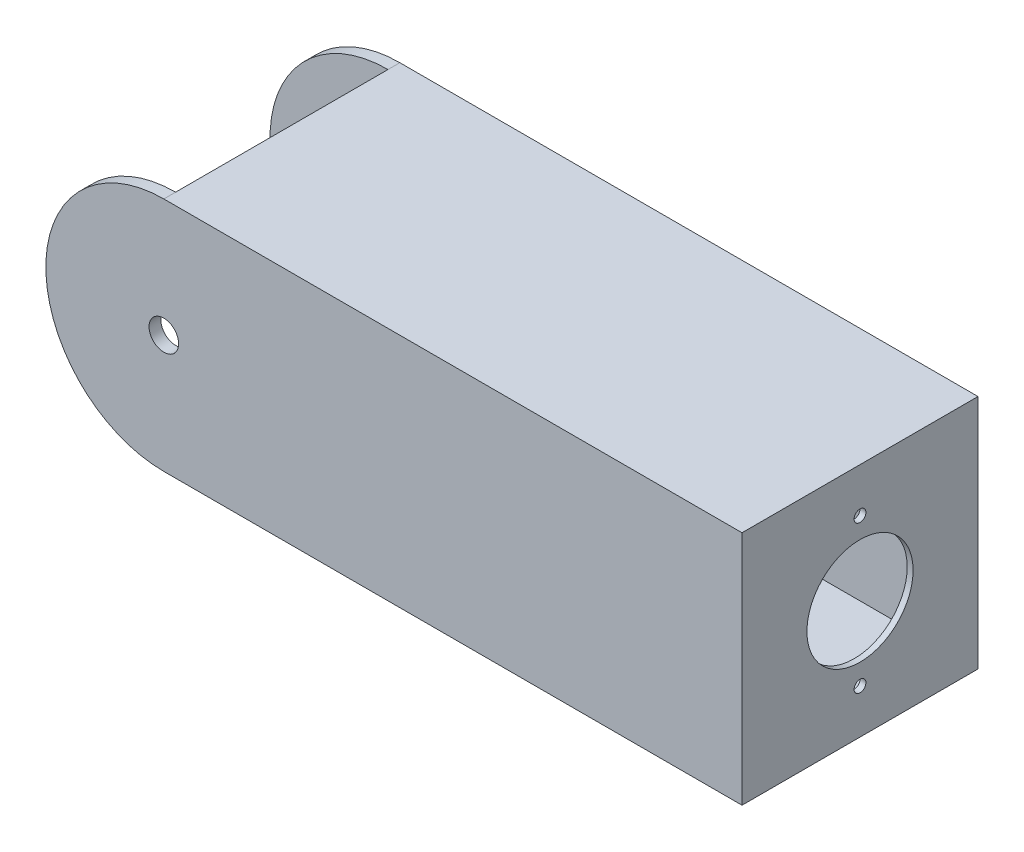
ISO-10303-21;
HEADER;
FILE_DESCRIPTION(('STEP AP214'),'2;1');
FILE_NAME('part.step','',(''),(''),'','','');
FILE_SCHEMA(('AUTOMOTIVE_DESIGN { 1 0 10303 214 1 1 1 1 }'));
ENDSEC;
DATA;
#1=APPLICATION_CONTEXT('core data for automotive mechanical design processes');
#2=APPLICATION_PROTOCOL_DEFINITION('international standard','automotive_design',2000,#1);
#3=PRODUCT_CONTEXT('',#1,'mechanical');
#4=PRODUCT('Part','Part','',(#3));
#5=PRODUCT_RELATED_PRODUCT_CATEGORY('part','',(#4));
#6=PRODUCT_DEFINITION_FORMATION('','',#4);
#7=PRODUCT_DEFINITION_CONTEXT('part definition',#1,'design');
#8=PRODUCT_DEFINITION('design','',#6,#7);
#9=PRODUCT_DEFINITION_SHAPE('','',#8);
#10=(LENGTH_UNIT() NAMED_UNIT(*) SI_UNIT(.MILLI.,.METRE.));
#11=(NAMED_UNIT(*) PLANE_ANGLE_UNIT() SI_UNIT($,.RADIAN.));
#12=(NAMED_UNIT(*) SI_UNIT($,.STERADIAN.) SOLID_ANGLE_UNIT());
#13=UNCERTAINTY_MEASURE_WITH_UNIT(LENGTH_MEASURE(1.E-05),#10,'distance_accuracy_value','');
#14=(GEOMETRIC_REPRESENTATION_CONTEXT(3) GLOBAL_UNCERTAINTY_ASSIGNED_CONTEXT((#13)) GLOBAL_UNIT_ASSIGNED_CONTEXT((#10,
#11,#12)) REPRESENTATION_CONTEXT('',''));
#15=CARTESIAN_POINT('',(0.,0.,0.));
#16=DIRECTION('',(0.,0.,1.));
#17=DIRECTION('',(1.,0.,0.));
#18=AXIS2_PLACEMENT_3D('',#15,#16,#17);
#19=CARTESIAN_POINT('',(72.39,0.,0.));
#20=DIRECTION('',(-1.,0.,0.));
#21=DIRECTION('',(0.,0.,1.));
#22=AXIS2_PLACEMENT_3D('',#19,#20,#21);
#23=PLANE('',#22);
#24=DIRECTION('',(0.,1.,0.));
#25=VECTOR('',#24,1.);
#26=CARTESIAN_POINT('',(72.39,-22.86,-22.86));
#27=LINE('',#26,#25);
#28=CARTESIAN_POINT('',(72.39,-22.86,-22.86));
#29=VERTEX_POINT('',#28);
#30=CARTESIAN_POINT('',(72.39,22.86,-22.86));
#31=VERTEX_POINT('',#30);
#32=EDGE_CURVE('E152',#29,#31,#27,.T.);
#33=ORIENTED_EDGE('',*,*,#32,.F.);
#34=DIRECTION('',(0.,0.,-1.));
#35=VECTOR('',#34,1.);
#36=CARTESIAN_POINT('',(72.39,-22.86,22.86));
#37=LINE('',#36,#35);
#38=CARTESIAN_POINT('',(72.39,-22.86,22.86));
#39=VERTEX_POINT('',#38);
#40=EDGE_CURVE('E225',#39,#29,#37,.T.);
#41=ORIENTED_EDGE('',*,*,#40,.F.);
#42=DIRECTION('',(0.,-1.,0.));
#43=VECTOR('',#42,1.);
#44=CARTESIAN_POINT('',(72.39,-22.86,22.86));
#45=LINE('',#44,#43);
#46=CARTESIAN_POINT('',(72.39,22.86,22.86));
#47=VERTEX_POINT('',#46);
#48=EDGE_CURVE('E222',#47,#39,#45,.T.);
#49=ORIENTED_EDGE('',*,*,#48,.F.);
#50=DIRECTION('',(0.,0.,1.));
#51=VECTOR('',#50,1.);
#52=CARTESIAN_POINT('',(72.39,22.86,22.86));
#53=LINE('',#52,#51);
#54=EDGE_CURVE('E219',#31,#47,#53,.T.);
#55=ORIENTED_EDGE('',*,*,#54,.F.);
#56=EDGE_LOOP('',(#33,#41,#49,#55));
#57=FACE_BOUND('',#56,.T.);
#58=CARTESIAN_POINT('',(72.39,15.875,0.));
#59=DIRECTION('',(-1.,0.,0.));
#60=DIRECTION('',(0.,0.,1.));
#61=AXIS2_PLACEMENT_3D('',#58,#59,#60);
#62=CIRCLE('',#61,1.27);
#63=CARTESIAN_POINT('',(72.39,15.875,1.27));
#64=VERTEX_POINT('',#63);
#65=EDGE_CURVE('E285',#64,#64,#62,.F.);
#66=ORIENTED_EDGE('',*,*,#65,.T.);
#67=EDGE_LOOP('',(#66));
#68=FACE_BOUND('',#67,.T.);
#69=CARTESIAN_POINT('',(72.39,-15.875,0.));
#70=DIRECTION('',(-1.,0.,0.));
#71=DIRECTION('',(0.,0.,1.));
#72=AXIS2_PLACEMENT_3D('',#69,#70,#71);
#73=CIRCLE('',#72,1.27);
#74=CARTESIAN_POINT('',(72.39,-15.875,1.27));
#75=VERTEX_POINT('',#74);
#76=EDGE_CURVE('E290',#75,#75,#73,.F.);
#77=ORIENTED_EDGE('',*,*,#76,.T.);
#78=EDGE_LOOP('',(#77));
#79=FACE_BOUND('',#78,.T.);
#80=CARTESIAN_POINT('',(72.39,0.,0.));
#81=DIRECTION('',(-1.,0.,0.));
#82=DIRECTION('',(0.,0.,1.));
#83=AXIS2_PLACEMENT_3D('',#80,#81,#82);
#84=CIRCLE('',#83,11.43);
#85=CARTESIAN_POINT('',(72.39,0.,11.43));
#86=VERTEX_POINT('',#85);
#87=EDGE_CURVE('E292',#86,#86,#84,.F.);
#88=ORIENTED_EDGE('',*,*,#87,.T.);
#89=EDGE_LOOP('',(#88));
#90=FACE_BOUND('',#89,.T.);
#91=ADVANCED_FACE('F42',(#57,#68,#79,#90),#23,.T.);
#92=CARTESIAN_POINT('',(-50.8,0.,-25.4));
#93=DIRECTION('',(0.,0.,1.));
#94=DIRECTION('',(1.,0.,0.));
#95=AXIS2_PLACEMENT_3D('',#92,#93,#94);
#96=CYLINDRICAL_SURFACE('',#95,25.4);
#97=CARTESIAN_POINT('',(-50.8,0.,22.86));
#98=DIRECTION('',(0.,0.,1.));
#99=DIRECTION('',(1.,0.,0.));
#100=AXIS2_PLACEMENT_3D('',#97,#98,#99);
#101=CIRCLE('',#100,25.4);
#102=CARTESIAN_POINT('',(-50.8,-25.4,22.86));
#103=VERTEX_POINT('',#102);
#104=CARTESIAN_POINT('',(-50.8,25.4,22.86));
#105=VERTEX_POINT('',#104);
#106=EDGE_CURVE('E170',#103,#105,#101,.F.);
#107=ORIENTED_EDGE('',*,*,#106,.F.);
#108=DIRECTION('',(0.,0.,1.));
#109=VECTOR('',#108,1.);
#110=CARTESIAN_POINT('',(-50.8,-25.4,-25.4));
#111=LINE('',#110,#109);
#112=CARTESIAN_POINT('',(-50.8,-25.4,25.4));
#113=VERTEX_POINT('',#112);
#114=EDGE_CURVE('E151',#103,#113,#111,.T.);
#115=ORIENTED_EDGE('',*,*,#114,.T.);
#116=CARTESIAN_POINT('',(-50.8,0.,25.4));
#117=DIRECTION('',(0.,0.,1.));
#118=DIRECTION('',(1.,0.,0.));
#119=AXIS2_PLACEMENT_3D('',#116,#117,#118);
#120=CIRCLE('',#119,25.4);
#121=CARTESIAN_POINT('',(-50.8,25.4,25.4));
#122=VERTEX_POINT('',#121);
#123=EDGE_CURVE('E201',#122,#113,#120,.T.);
#124=ORIENTED_EDGE('',*,*,#123,.F.);
#125=DIRECTION('',(0.,0.,1.));
#126=VECTOR('',#125,1.);
#127=CARTESIAN_POINT('',(-50.8,25.4,-25.4));
#128=LINE('',#127,#126);
#129=EDGE_CURVE('E165',#105,#122,#128,.T.);
#130=ORIENTED_EDGE('',*,*,#129,.F.);
#131=EDGE_LOOP('',(#107,#115,#124,#130));
#132=FACE_BOUND('',#131,.T.);
#133=ADVANCED_FACE('F209',(#132),#96,.T.);
#134=CARTESIAN_POINT('',(-50.8,0.,-25.4));
#135=DIRECTION('',(0.,0.,1.));
#136=DIRECTION('',(1.,0.,0.));
#137=AXIS2_PLACEMENT_3D('',#134,#135,#136);
#138=CYLINDRICAL_SURFACE('',#137,3.18135);
#139=CARTESIAN_POINT('',(-50.8,0.,-22.86));
#140=DIRECTION('',(0.,0.,-1.));
#141=DIRECTION('',(-1.,0.,0.));
#142=AXIS2_PLACEMENT_3D('',#139,#140,#141);
#143=CIRCLE('',#142,3.18135);
#144=CARTESIAN_POINT('',(-53.98135,0.,-22.86));
#145=VERTEX_POINT('',#144);
#146=EDGE_CURVE('E134',#145,#145,#143,.F.);
#147=ORIENTED_EDGE('',*,*,#146,.T.);
#148=EDGE_LOOP('',(#147));
#149=FACE_BOUND('',#148,.T.);
#150=CARTESIAN_POINT('',(-50.8,0.,-25.4));
#151=DIRECTION('',(0.,0.,1.));
#152=DIRECTION('',(1.,0.,0.));
#153=AXIS2_PLACEMENT_3D('',#150,#151,#152);
#154=CIRCLE('',#153,3.18135);
#155=CARTESIAN_POINT('',(-47.61865,0.,-25.4));
#156=VERTEX_POINT('',#155);
#157=EDGE_CURVE('E183',#156,#156,#154,.T.);
#158=ORIENTED_EDGE('',*,*,#157,.F.);
#159=EDGE_LOOP('',(#158));
#160=FACE_BOUND('',#159,.T.);
#161=ADVANCED_FACE('F264',(#149,#160),#138,.F.);
#162=CARTESIAN_POINT('',(73.66,25.4,-25.4));
#163=DIRECTION('',(1.,0.,0.));
#164=DIRECTION('',(0.,0.,-1.));
#165=AXIS2_PLACEMENT_3D('',#162,#163,#164);
#166=PLANE('',#165);
#167=CARTESIAN_POINT('',(73.66,-15.875,0.));
#168=DIRECTION('',(1.,0.,0.));
#169=DIRECTION('',(0.,0.,-1.));
#170=AXIS2_PLACEMENT_3D('',#167,#168,#169);
#171=CIRCLE('',#170,1.27);
#172=CARTESIAN_POINT('',(73.66,-15.875,-1.27));
#173=VERTEX_POINT('',#172);
#174=EDGE_CURVE('E295',#173,#173,#171,.T.);
#175=ORIENTED_EDGE('',*,*,#174,.F.);
#176=EDGE_LOOP('',(#175));
#177=FACE_BOUND('',#176,.T.);
#178=CARTESIAN_POINT('',(73.66,15.875,0.));
#179=DIRECTION('',(1.,0.,0.));
#180=DIRECTION('',(0.,0.,-1.));
#181=AXIS2_PLACEMENT_3D('',#178,#179,#180);
#182=CIRCLE('',#181,1.27);
#183=CARTESIAN_POINT('',(73.66,15.875,-1.27));
#184=VERTEX_POINT('',#183);
#185=EDGE_CURVE('E288',#184,#184,#182,.T.);
#186=ORIENTED_EDGE('',*,*,#185,.F.);
#187=EDGE_LOOP('',(#186));
#188=FACE_BOUND('',#187,.T.);
#189=CARTESIAN_POINT('',(73.66,0.,0.));
#190=DIRECTION('',(1.,0.,0.));
#191=DIRECTION('',(0.,0.,-1.));
#192=AXIS2_PLACEMENT_3D('',#189,#190,#191);
#193=CIRCLE('',#192,11.43);
#194=CARTESIAN_POINT('',(73.66,0.,-11.43));
#195=VERTEX_POINT('',#194);
#196=EDGE_CURVE('E300',#195,#195,#193,.T.);
#197=ORIENTED_EDGE('',*,*,#196,.F.);
#198=EDGE_LOOP('',(#197));
#199=FACE_BOUND('',#198,.T.);
#200=DIRECTION('',(0.,1.,0.));
#201=VECTOR('',#200,1.);
#202=CARTESIAN_POINT('',(73.66,25.4,25.4));
#203=LINE('',#202,#201);
#204=CARTESIAN_POINT('',(73.66,-25.4,25.4));
#205=VERTEX_POINT('',#204);
#206=CARTESIAN_POINT('',(73.66,25.4,25.4));
#207=VERTEX_POINT('',#206);
#208=EDGE_CURVE('E186',#205,#207,#203,.T.);
#209=ORIENTED_EDGE('',*,*,#208,.F.);
#210=DIRECTION('',(0.,0.,1.));
#211=VECTOR('',#210,1.);
#212=CARTESIAN_POINT('',(73.66,-25.4,-25.4));
#213=LINE('',#212,#211);
#214=CARTESIAN_POINT('',(73.66,-25.4,-25.4));
#215=VERTEX_POINT('',#214);
#216=EDGE_CURVE('E50',#215,#205,#213,.T.);
#217=ORIENTED_EDGE('',*,*,#216,.F.);
#218=DIRECTION('',(0.,1.,0.));
#219=VECTOR('',#218,1.);
#220=CARTESIAN_POINT('',(73.66,25.4,-25.4));
#221=LINE('',#220,#219);
#222=CARTESIAN_POINT('',(73.66,25.4,-25.4));
#223=VERTEX_POINT('',#222);
#224=EDGE_CURVE('E189',#215,#223,#221,.T.);
#225=ORIENTED_EDGE('',*,*,#224,.T.);
#226=DIRECTION('',(0.,0.,1.));
#227=VECTOR('',#226,1.);
#228=CARTESIAN_POINT('',(73.66,25.4,-25.4));
#229=LINE('',#228,#227);
#230=EDGE_CURVE('E91',#223,#207,#229,.T.);
#231=ORIENTED_EDGE('',*,*,#230,.T.);
#232=EDGE_LOOP('',(#209,#217,#225,#231));
#233=FACE_BOUND('',#232,.T.);
#234=ADVANCED_FACE('F44',(#177,#188,#199,#233),#166,.T.);
#235=CARTESIAN_POINT('',(-50.8,-25.4,-25.4));
#236=DIRECTION('',(0.,-1.,0.));
#237=DIRECTION('',(1.,0.,0.));
#238=AXIS2_PLACEMENT_3D('',#235,#236,#237);
#239=PLANE('',#238);
#240=DIRECTION('',(1.,0.,0.));
#241=VECTOR('',#240,1.);
#242=CARTESIAN_POINT('',(-50.8,-25.4,25.4));
#243=LINE('',#242,#241);
#244=EDGE_CURVE('E192',#113,#205,#243,.T.);
#245=ORIENTED_EDGE('',*,*,#244,.F.);
#246=ORIENTED_EDGE('',*,*,#114,.F.);
#247=DIRECTION('',(0.,0.,1.));
#248=VECTOR('',#247,1.);
#249=CARTESIAN_POINT('',(-50.8,-25.4,-25.4));
#250=LINE('',#249,#248);
#251=CARTESIAN_POINT('',(-50.8,-25.4,-22.86));
#252=VERTEX_POINT('',#251);
#253=EDGE_CURVE('E140',#252,#103,#250,.T.);
#254=ORIENTED_EDGE('',*,*,#253,.F.);
#255=CARTESIAN_POINT('',(-50.8,-25.4,-25.4));
#256=VERTEX_POINT('',#255);
#257=EDGE_CURVE('E149',#256,#252,#111,.T.);
#258=ORIENTED_EDGE('',*,*,#257,.F.);
#259=DIRECTION('',(1.,0.,0.));
#260=VECTOR('',#259,1.);
#261=CARTESIAN_POINT('',(-50.8,-25.4,-25.4));
#262=LINE('',#261,#260);
#263=EDGE_CURVE('E167',#256,#215,#262,.T.);
#264=ORIENTED_EDGE('',*,*,#263,.T.);
#265=ORIENTED_EDGE('',*,*,#216,.T.);
#266=EDGE_LOOP('',(#245,#246,#254,#258,#264,#265));
#267=FACE_BOUND('',#266,.T.);
#268=ADVANCED_FACE('F148',(#267),#239,.T.);
#269=ORIENTED_EDGE('',*,*,#257,.T.);
#270=CARTESIAN_POINT('',(-50.8,0.,-22.86));
#271=DIRECTION('',(0.,0.,-1.));
#272=DIRECTION('',(-1.,0.,0.));
#273=AXIS2_PLACEMENT_3D('',#270,#271,#272);
#274=CIRCLE('',#273,25.4);
#275=CARTESIAN_POINT('',(-50.8,25.4,-22.86));
#276=VERTEX_POINT('',#275);
#277=EDGE_CURVE('E125',#276,#252,#274,.F.);
#278=ORIENTED_EDGE('',*,*,#277,.F.);
#279=CARTESIAN_POINT('',(-50.8,25.4,-25.4));
#280=VERTEX_POINT('',#279);
#281=EDGE_CURVE('E161',#280,#276,#128,.T.);
#282=ORIENTED_EDGE('',*,*,#281,.F.);
#283=CARTESIAN_POINT('',(-50.8,0.,-25.4));
#284=DIRECTION('',(0.,0.,1.));
#285=DIRECTION('',(1.,0.,0.));
#286=AXIS2_PLACEMENT_3D('',#283,#284,#285);
#287=CIRCLE('',#286,25.4);
#288=EDGE_CURVE('E157',#280,#256,#287,.T.);
#289=ORIENTED_EDGE('',*,*,#288,.T.);
#290=EDGE_LOOP('',(#269,#278,#282,#289));
#291=FACE_BOUND('',#290,.T.);
#292=ADVANCED_FACE('F155',(#291),#96,.T.);
#293=CARTESIAN_POINT('',(-50.8,25.4,-25.4));
#294=DIRECTION('',(0.,1.,0.));
#295=DIRECTION('',(0.,0.,1.));
#296=AXIS2_PLACEMENT_3D('',#293,#294,#295);
#297=PLANE('',#296);
#298=DIRECTION('',(-1.,0.,0.));
#299=VECTOR('',#298,1.);
#300=CARTESIAN_POINT('',(-50.8,25.4,25.4));
#301=LINE('',#300,#299);
#302=EDGE_CURVE('E198',#207,#122,#301,.T.);
#303=ORIENTED_EDGE('',*,*,#302,.F.);
#304=ORIENTED_EDGE('',*,*,#230,.F.);
#305=DIRECTION('',(-1.,0.,0.));
#306=VECTOR('',#305,1.);
#307=CARTESIAN_POINT('',(-50.8,25.4,-25.4));
#308=LINE('',#307,#306);
#309=EDGE_CURVE('E191',#223,#280,#308,.T.);
#310=ORIENTED_EDGE('',*,*,#309,.T.);
#311=ORIENTED_EDGE('',*,*,#281,.T.);
#312=DIRECTION('',(0.,0.,-1.));
#313=VECTOR('',#312,1.);
#314=CARTESIAN_POINT('',(-50.8,25.4,-25.4));
#315=LINE('',#314,#313);
#316=EDGE_CURVE('E153',#105,#276,#315,.T.);
#317=ORIENTED_EDGE('',*,*,#316,.F.);
#318=ORIENTED_EDGE('',*,*,#129,.T.);
#319=EDGE_LOOP('',(#303,#304,#310,#311,#317,#318));
#320=FACE_BOUND('',#319,.T.);
#321=ADVANCED_FACE('F211',(#320),#297,.T.);
#322=CARTESIAN_POINT('',(-50.8,0.,-25.4));
#323=DIRECTION('',(0.,0.,1.));
#324=DIRECTION('',(1.,0.,0.));
#325=AXIS2_PLACEMENT_3D('',#322,#323,#324);
#326=PLANE('',#325);
#327=ORIENTED_EDGE('',*,*,#157,.T.);
#328=EDGE_LOOP('',(#327));
#329=FACE_BOUND('',#328,.T.);
#330=ORIENTED_EDGE('',*,*,#224,.F.);
#331=ORIENTED_EDGE('',*,*,#263,.F.);
#332=ORIENTED_EDGE('',*,*,#288,.F.);
#333=ORIENTED_EDGE('',*,*,#309,.F.);
#334=EDGE_LOOP('',(#330,#331,#332,#333));
#335=FACE_BOUND('',#334,.T.);
#336=ADVANCED_FACE('F315',(#329,#335),#326,.F.);
#337=CARTESIAN_POINT('',(-50.8,0.,25.4));
#338=DIRECTION('',(0.,0.,1.));
#339=DIRECTION('',(1.,0.,0.));
#340=AXIS2_PLACEMENT_3D('',#337,#338,#339);
#341=PLANE('',#340);
#342=CARTESIAN_POINT('',(-50.8,0.,25.4));
#343=DIRECTION('',(0.,0.,1.));
#344=DIRECTION('',(1.,0.,0.));
#345=AXIS2_PLACEMENT_3D('',#342,#343,#344);
#346=CIRCLE('',#345,3.18135);
#347=CARTESIAN_POINT('',(-47.61865,0.,25.4));
#348=VERTEX_POINT('',#347);
#349=EDGE_CURVE('E133',#348,#348,#346,.T.);
#350=ORIENTED_EDGE('',*,*,#349,.F.);
#351=EDGE_LOOP('',(#350));
#352=FACE_BOUND('',#351,.T.);
#353=ORIENTED_EDGE('',*,*,#208,.T.);
#354=ORIENTED_EDGE('',*,*,#302,.T.);
#355=ORIENTED_EDGE('',*,*,#123,.T.);
#356=ORIENTED_EDGE('',*,*,#244,.T.);
#357=EDGE_LOOP('',(#353,#354,#355,#356));
#358=FACE_BOUND('',#357,.T.);
#359=ADVANCED_FACE('F205',(#352,#358),#341,.T.);
#360=CARTESIAN_POINT('',(-50.8,0.,22.86));
#361=DIRECTION('',(0.,0.,1.));
#362=DIRECTION('',(1.,0.,0.));
#363=AXIS2_PLACEMENT_3D('',#360,#361,#362);
#364=CIRCLE('',#363,3.18135);
#365=CARTESIAN_POINT('',(-47.61865,0.,22.86));
#366=VERTEX_POINT('',#365);
#367=EDGE_CURVE('E168',#366,#366,#364,.F.);
#368=ORIENTED_EDGE('',*,*,#367,.T.);
#369=EDGE_LOOP('',(#368));
#370=FACE_BOUND('',#369,.T.);
#371=ORIENTED_EDGE('',*,*,#349,.T.);
#372=EDGE_LOOP('',(#371));
#373=FACE_BOUND('',#372,.T.);
#374=ADVANCED_FACE('F252',(#370,#373),#138,.F.);
#375=CARTESIAN_POINT('',(-72.39,-22.86,-22.86));
#376=DIRECTION('',(0.,0.,-1.));
#377=DIRECTION('',(-1.,0.,0.));
#378=AXIS2_PLACEMENT_3D('',#375,#376,#377);
#379=PLANE('',#378);
#380=ORIENTED_EDGE('',*,*,#146,.F.);
#381=EDGE_LOOP('',(#380));
#382=FACE_BOUND('',#381,.T.);
#383=DIRECTION('',(1.,0.,0.));
#384=VECTOR('',#383,1.);
#385=CARTESIAN_POINT('',(-72.39,22.86,-22.86));
#386=LINE('',#385,#384);
#387=CARTESIAN_POINT('',(-50.8,22.86,-22.86));
#388=VERTEX_POINT('',#387);
#389=EDGE_CURVE('E180',#388,#31,#386,.T.);
#390=ORIENTED_EDGE('',*,*,#389,.F.);
#391=DIRECTION('',(0.,1.,0.));
#392=VECTOR('',#391,1.);
#393=CARTESIAN_POINT('',(-50.8,-83.82,-22.86));
#394=LINE('',#393,#392);
#395=EDGE_CURVE('E128',#388,#276,#394,.T.);
#396=ORIENTED_EDGE('',*,*,#395,.T.);
#397=ORIENTED_EDGE('',*,*,#277,.T.);
#398=CARTESIAN_POINT('',(-50.8,-22.86,-22.86));
#399=VERTEX_POINT('',#398);
#400=EDGE_CURVE('E57',#252,#399,#394,.T.);
#401=ORIENTED_EDGE('',*,*,#400,.T.);
#402=DIRECTION('',(1.,0.,0.));
#403=VECTOR('',#402,1.);
#404=CARTESIAN_POINT('',(-72.39,-22.86,-22.86));
#405=LINE('',#404,#403);
#406=EDGE_CURVE('E171',#399,#29,#405,.T.);
#407=ORIENTED_EDGE('',*,*,#406,.T.);
#408=ORIENTED_EDGE('',*,*,#32,.T.);
#409=EDGE_LOOP('',(#390,#396,#397,#401,#407,#408));
#410=FACE_BOUND('',#409,.T.);
#411=ADVANCED_FACE('F127',(#382,#410),#379,.F.);
#412=CARTESIAN_POINT('',(-72.39,-22.86,22.86));
#413=DIRECTION('',(0.,0.,1.));
#414=DIRECTION('',(1.,0.,0.));
#415=AXIS2_PLACEMENT_3D('',#412,#413,#414);
#416=PLANE('',#415);
#417=ORIENTED_EDGE('',*,*,#367,.F.);
#418=EDGE_LOOP('',(#417));
#419=FACE_BOUND('',#418,.T.);
#420=DIRECTION('',(1.,0.,0.));
#421=VECTOR('',#420,1.);
#422=CARTESIAN_POINT('',(-72.39,-22.86,22.86));
#423=LINE('',#422,#421);
#424=CARTESIAN_POINT('',(-50.8,-22.86,22.86));
#425=VERTEX_POINT('',#424);
#426=EDGE_CURVE('E229',#425,#39,#423,.T.);
#427=ORIENTED_EDGE('',*,*,#426,.F.);
#428=DIRECTION('',(0.,1.,0.));
#429=VECTOR('',#428,1.);
#430=CARTESIAN_POINT('',(-50.8,-83.82,22.86));
#431=LINE('',#430,#429);
#432=EDGE_CURVE('E214',#103,#425,#431,.T.);
#433=ORIENTED_EDGE('',*,*,#432,.F.);
#434=ORIENTED_EDGE('',*,*,#106,.T.);
#435=CARTESIAN_POINT('',(-50.8,22.86,22.86));
#436=VERTEX_POINT('',#435);
#437=EDGE_CURVE('E145',#436,#105,#431,.T.);
#438=ORIENTED_EDGE('',*,*,#437,.F.);
#439=DIRECTION('',(1.,0.,0.));
#440=VECTOR('',#439,1.);
#441=CARTESIAN_POINT('',(-72.39,22.86,22.86));
#442=LINE('',#441,#440);
#443=EDGE_CURVE('E230',#436,#47,#442,.T.);
#444=ORIENTED_EDGE('',*,*,#443,.T.);
#445=ORIENTED_EDGE('',*,*,#48,.T.);
#446=EDGE_LOOP('',(#427,#433,#434,#438,#444,#445));
#447=FACE_BOUND('',#446,.T.);
#448=ADVANCED_FACE('F243',(#419,#447),#416,.F.);
#449=CARTESIAN_POINT('',(-72.39,-22.86,22.86));
#450=DIRECTION('',(0.,-1.,0.));
#451=DIRECTION('',(0.,0.,-1.));
#452=AXIS2_PLACEMENT_3D('',#449,#450,#451);
#453=PLANE('',#452);
#454=ORIENTED_EDGE('',*,*,#406,.F.);
#455=DIRECTION('',(0.,0.,1.));
#456=VECTOR('',#455,1.);
#457=CARTESIAN_POINT('',(-50.8,-22.86,22.86));
#458=LINE('',#457,#456);
#459=EDGE_CURVE('E143',#399,#425,#458,.T.);
#460=ORIENTED_EDGE('',*,*,#459,.T.);
#461=ORIENTED_EDGE('',*,*,#426,.T.);
#462=ORIENTED_EDGE('',*,*,#40,.T.);
#463=EDGE_LOOP('',(#454,#460,#461,#462));
#464=FACE_BOUND('',#463,.T.);
#465=ADVANCED_FACE('F241',(#464),#453,.F.);
#466=CARTESIAN_POINT('',(-72.39,22.86,22.86));
#467=DIRECTION('',(0.,1.,0.));
#468=DIRECTION('',(0.,0.,1.));
#469=AXIS2_PLACEMENT_3D('',#466,#467,#468);
#470=PLANE('',#469);
#471=ORIENTED_EDGE('',*,*,#443,.F.);
#472=DIRECTION('',(0.,0.,-1.));
#473=VECTOR('',#472,1.);
#474=CARTESIAN_POINT('',(-50.8,22.86,22.86));
#475=LINE('',#474,#473);
#476=EDGE_CURVE('E11',#436,#388,#475,.T.);
#477=ORIENTED_EDGE('',*,*,#476,.T.);
#478=ORIENTED_EDGE('',*,*,#389,.T.);
#479=ORIENTED_EDGE('',*,*,#54,.T.);
#480=EDGE_LOOP('',(#471,#477,#478,#479));
#481=FACE_BOUND('',#480,.T.);
#482=ADVANCED_FACE('F235',(#481),#470,.F.);
#483=CARTESIAN_POINT('',(-50.8,-83.82,22.86));
#484=DIRECTION('',(1.,0.,0.));
#485=DIRECTION('',(0.,0.,-1.));
#486=AXIS2_PLACEMENT_3D('',#483,#484,#485);
#487=PLANE('',#486);
#488=ORIENTED_EDGE('',*,*,#316,.T.);
#489=ORIENTED_EDGE('',*,*,#395,.F.);
#490=ORIENTED_EDGE('',*,*,#476,.F.);
#491=ORIENTED_EDGE('',*,*,#437,.T.);
#492=EDGE_LOOP('',(#488,#489,#490,#491));
#493=FACE_BOUND('',#492,.T.);
#494=ADVANCED_FACE('F269',(#493),#487,.F.);
#495=ORIENTED_EDGE('',*,*,#253,.T.);
#496=ORIENTED_EDGE('',*,*,#432,.T.);
#497=ORIENTED_EDGE('',*,*,#459,.F.);
#498=ORIENTED_EDGE('',*,*,#400,.F.);
#499=EDGE_LOOP('',(#495,#496,#497,#498));
#500=FACE_BOUND('',#499,.T.);
#501=ADVANCED_FACE('F139',(#500),#487,.F.);
#502=CARTESIAN_POINT('',(-76.201,15.875,0.));
#503=DIRECTION('',(1.,0.,0.));
#504=DIRECTION('',(0.,0.,-1.));
#505=AXIS2_PLACEMENT_3D('',#502,#503,#504);
#506=CYLINDRICAL_SURFACE('',#505,1.27);
#507=ORIENTED_EDGE('',*,*,#65,.F.);
#508=EDGE_LOOP('',(#507));
#509=FACE_BOUND('',#508,.T.);
#510=ORIENTED_EDGE('',*,*,#185,.T.);
#511=EDGE_LOOP('',(#510));
#512=FACE_BOUND('',#511,.T.);
#513=ADVANCED_FACE('F268',(#509,#512),#506,.F.);
#514=CARTESIAN_POINT('',(-76.201,-15.875,0.));
#515=DIRECTION('',(1.,0.,0.));
#516=DIRECTION('',(0.,0.,-1.));
#517=AXIS2_PLACEMENT_3D('',#514,#515,#516);
#518=CYLINDRICAL_SURFACE('',#517,1.27);
#519=ORIENTED_EDGE('',*,*,#76,.F.);
#520=EDGE_LOOP('',(#519));
#521=FACE_BOUND('',#520,.T.);
#522=ORIENTED_EDGE('',*,*,#174,.T.);
#523=EDGE_LOOP('',(#522));
#524=FACE_BOUND('',#523,.T.);
#525=ADVANCED_FACE('F273',(#521,#524),#518,.F.);
#526=CARTESIAN_POINT('',(-76.201,0.,0.));
#527=DIRECTION('',(1.,0.,0.));
#528=DIRECTION('',(0.,0.,-1.));
#529=AXIS2_PLACEMENT_3D('',#526,#527,#528);
#530=CYLINDRICAL_SURFACE('',#529,11.43);
#531=ORIENTED_EDGE('',*,*,#87,.F.);
#532=EDGE_LOOP('',(#531));
#533=FACE_BOUND('',#532,.T.);
#534=ORIENTED_EDGE('',*,*,#196,.T.);
#535=EDGE_LOOP('',(#534));
#536=FACE_BOUND('',#535,.T.);
#537=ADVANCED_FACE('F270',(#533,#536),#530,.F.);
#538=CLOSED_SHELL('',(#91,#133,#161,#234,#268,#292,#321,#336,#359,#374,#411,#448,#465,#482,#494,
#501,#513,#525,#537));
#539=MANIFOLD_SOLID_BREP('B2',#538);
#540=ADVANCED_BREP_SHAPE_REPRESENTATION('',(#18,#539),#14);
#541=SHAPE_DEFINITION_REPRESENTATION(#9,#540);
ENDSEC;
END-ISO-10303-21;
